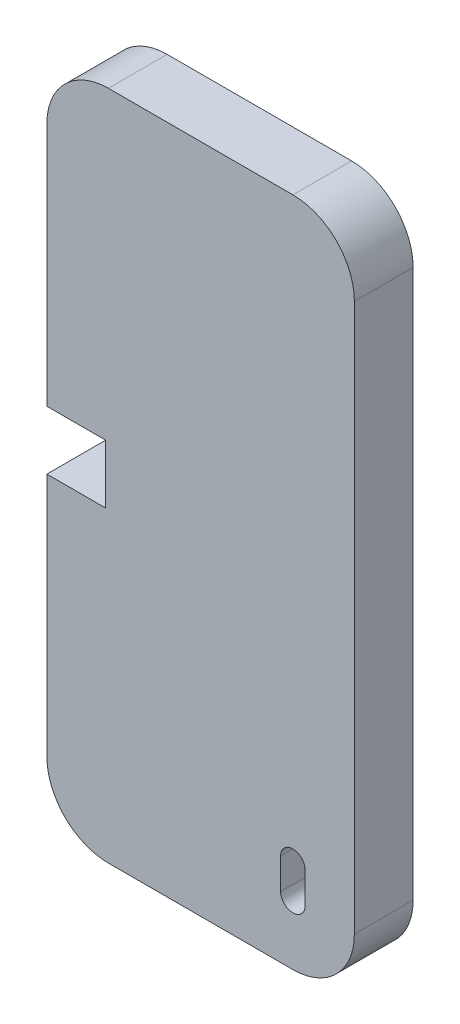
ISO-10303-21;
HEADER;
FILE_DESCRIPTION(('STEP AP214'),'2;1');
FILE_NAME('part.step','',(''),(''),'','','');
FILE_SCHEMA(('AUTOMOTIVE_DESIGN { 1 0 10303 214 1 1 1 1 }'));
ENDSEC;
DATA;
#1=APPLICATION_CONTEXT('core data for automotive mechanical design processes');
#2=APPLICATION_PROTOCOL_DEFINITION('international standard','automotive_design',2000,#1);
#3=PRODUCT_CONTEXT('',#1,'mechanical');
#4=PRODUCT('Part','Part','',(#3));
#5=PRODUCT_RELATED_PRODUCT_CATEGORY('part','',(#4));
#6=PRODUCT_DEFINITION_FORMATION('','',#4);
#7=PRODUCT_DEFINITION_CONTEXT('part definition',#1,'design');
#8=PRODUCT_DEFINITION('design','',#6,#7);
#9=PRODUCT_DEFINITION_SHAPE('','',#8);
#10=(LENGTH_UNIT() NAMED_UNIT(*) SI_UNIT(.MILLI.,.METRE.));
#11=(NAMED_UNIT(*) PLANE_ANGLE_UNIT() SI_UNIT($,.RADIAN.));
#12=(NAMED_UNIT(*) SI_UNIT($,.STERADIAN.) SOLID_ANGLE_UNIT());
#13=UNCERTAINTY_MEASURE_WITH_UNIT(LENGTH_MEASURE(1.E-05),#10,'distance_accuracy_value','');
#14=(GEOMETRIC_REPRESENTATION_CONTEXT(3) GLOBAL_UNCERTAINTY_ASSIGNED_CONTEXT((#13)) GLOBAL_UNIT_ASSIGNED_CONTEXT((#10,
#11,#12)) REPRESENTATION_CONTEXT('',''));
#15=CARTESIAN_POINT('',(0.,0.,0.));
#16=DIRECTION('',(0.,0.,1.));
#17=DIRECTION('',(1.,0.,0.));
#18=AXIS2_PLACEMENT_3D('',#15,#16,#17);
#19=CARTESIAN_POINT('',(-4.55039999999973,44.7752,4.7752));
#20=DIRECTION('',(1.,0.,0.));
#21=DIRECTION('',(0.,1.,0.));
#22=AXIS2_PLACEMENT_3D('',#19,#20,#21);
#23=PLANE('',#22);
#24=DIRECTION('',(0.,0.,1.));
#25=VECTOR('',#24,1.);
#26=CARTESIAN_POINT('',(-4.55039999999981,20.1124,0.));
#27=LINE('',#26,#25);
#28=CARTESIAN_POINT('',(-4.55039999999981,20.1124,0.));
#29=VERTEX_POINT('',#28);
#30=CARTESIAN_POINT('',(-4.55039999999981,20.1124,4.7752));
#31=VERTEX_POINT('',#30);
#32=EDGE_CURVE('E205',#29,#31,#27,.T.);
#33=ORIENTED_EDGE('',*,*,#32,.F.);
#34=DIRECTION('',(0.,-1.,0.));
#35=VECTOR('',#34,1.);
#36=CARTESIAN_POINT('',(-4.55039999999973,44.7752,0.));
#37=LINE('',#36,#35);
#38=CARTESIAN_POINT('',(-4.55039999999988,0.224799999999953,0.));
#39=VERTEX_POINT('',#38);
#40=EDGE_CURVE('E260',#29,#39,#37,.T.);
#41=ORIENTED_EDGE('',*,*,#40,.T.);
#42=DIRECTION('',(0.,0.,-1.));
#43=VECTOR('',#42,1.);
#44=CARTESIAN_POINT('',(-4.55039999999988,0.224799999999953,4.7752));
#45=LINE('',#44,#43);
#46=CARTESIAN_POINT('',(-4.55039999999988,0.224799999999953,4.7752));
#47=VERTEX_POINT('',#46);
#48=EDGE_CURVE('E305',#47,#39,#45,.T.);
#49=ORIENTED_EDGE('',*,*,#48,.F.);
#50=DIRECTION('',(0.,-1.,0.));
#51=VECTOR('',#50,1.);
#52=CARTESIAN_POINT('',(-4.55039999999973,44.7752,4.7752));
#53=LINE('',#52,#51);
#54=EDGE_CURVE('E232',#31,#47,#53,.T.);
#55=ORIENTED_EDGE('',*,*,#54,.F.);
#56=EDGE_LOOP('',(#33,#41,#49,#55));
#57=FACE_BOUND('',#56,.T.);
#58=ADVANCED_FACE('F44',(#57),#23,.F.);
#59=CARTESIAN_POINT('',(0.449600000000273,44.7751999999999,4.7752));
#60=DIRECTION('',(0.,0.,-1.));
#61=DIRECTION('',(-1.,0.,0.));
#62=AXIS2_PLACEMENT_3D('',#59,#60,#61);
#63=CYLINDRICAL_SURFACE('',#62,5.);
#64=CARTESIAN_POINT('',(0.449600000000273,44.7751999999999,0.));
#65=DIRECTION('',(0.,0.,1.));
#66=DIRECTION('',(-1.,0.,0.));
#67=AXIS2_PLACEMENT_3D('',#64,#65,#66);
#68=CIRCLE('',#67,5.);
#69=CARTESIAN_POINT('',(0.449600000000274,49.7751999999999,0.));
#70=VERTEX_POINT('',#69);
#71=CARTESIAN_POINT('',(-4.55039999999973,44.7752,0.));
#72=VERTEX_POINT('',#71);
#73=EDGE_CURVE('E219',#70,#72,#68,.T.);
#74=ORIENTED_EDGE('',*,*,#73,.T.);
#75=DIRECTION('',(0.,0.,-1.));
#76=VECTOR('',#75,1.);
#77=CARTESIAN_POINT('',(-4.55039999999973,44.7752,4.7752));
#78=LINE('',#77,#76);
#79=CARTESIAN_POINT('',(-4.55039999999973,44.7752,4.7752));
#80=VERTEX_POINT('',#79);
#81=EDGE_CURVE('E309',#80,#72,#78,.T.);
#82=ORIENTED_EDGE('',*,*,#81,.F.);
#83=CARTESIAN_POINT('',(0.449600000000273,44.7751999999999,4.7752));
#84=DIRECTION('',(0.,0.,1.));
#85=DIRECTION('',(-1.,0.,0.));
#86=AXIS2_PLACEMENT_3D('',#83,#84,#85);
#87=CIRCLE('',#86,5.);
#88=CARTESIAN_POINT('',(0.449600000000274,49.7751999999999,4.7752));
#89=VERTEX_POINT('',#88);
#90=EDGE_CURVE('E228',#89,#80,#87,.T.);
#91=ORIENTED_EDGE('',*,*,#90,.F.);
#92=DIRECTION('',(0.,0.,-1.));
#93=VECTOR('',#92,1.);
#94=CARTESIAN_POINT('',(0.449600000000274,49.7751999999999,4.7752));
#95=LINE('',#94,#93);
#96=EDGE_CURVE('E256',#89,#70,#95,.T.);
#97=ORIENTED_EDGE('',*,*,#96,.T.);
#98=EDGE_LOOP('',(#74,#82,#91,#97));
#99=FACE_BOUND('',#98,.T.);
#100=ADVANCED_FACE('F46',(#99),#63,.T.);
#101=CARTESIAN_POINT('',(-4.5503999999998,24.8876,0.));
#102=VERTEX_POINT('',#101);
#103=EDGE_CURVE('E261',#72,#102,#37,.T.);
#104=ORIENTED_EDGE('',*,*,#103,.T.);
#105=DIRECTION('',(0.,0.,1.));
#106=VECTOR('',#105,1.);
#107=CARTESIAN_POINT('',(-4.5503999999998,24.8876,0.));
#108=LINE('',#107,#106);
#109=CARTESIAN_POINT('',(-4.5503999999998,24.8876,4.7752));
#110=VERTEX_POINT('',#109);
#111=EDGE_CURVE('E215',#102,#110,#108,.T.);
#112=ORIENTED_EDGE('',*,*,#111,.T.);
#113=EDGE_CURVE('E234',#80,#110,#53,.T.);
#114=ORIENTED_EDGE('',*,*,#113,.F.);
#115=ORIENTED_EDGE('',*,*,#81,.T.);
#116=EDGE_LOOP('',(#104,#112,#114,#115));
#117=FACE_BOUND('',#116,.T.);
#118=ADVANCED_FACE('F343',(#117),#23,.F.);
#119=CARTESIAN_POINT('',(0.449600000000116,0.224799999999933,4.7752));
#120=DIRECTION('',(0.,0.,-1.));
#121=DIRECTION('',(-1.,0.,0.));
#122=AXIS2_PLACEMENT_3D('',#119,#120,#121);
#123=CYLINDRICAL_SURFACE('',#122,5.);
#124=CARTESIAN_POINT('',(0.449600000000116,0.224799999999933,0.));
#125=DIRECTION('',(0.,0.,1.));
#126=DIRECTION('',(1.,0.,0.));
#127=AXIS2_PLACEMENT_3D('',#124,#125,#126);
#128=CIRCLE('',#127,5.);
#129=CARTESIAN_POINT('',(0.449600000000115,-4.77520000000007,0.));
#130=VERTEX_POINT('',#129);
#131=EDGE_CURVE('E265',#39,#130,#128,.T.);
#132=ORIENTED_EDGE('',*,*,#131,.T.);
#133=DIRECTION('',(0.,0.,-1.));
#134=VECTOR('',#133,1.);
#135=CARTESIAN_POINT('',(0.449600000000115,-4.77520000000007,4.7752));
#136=LINE('',#135,#134);
#137=CARTESIAN_POINT('',(0.449600000000115,-4.77520000000007,4.7752));
#138=VERTEX_POINT('',#137);
#139=EDGE_CURVE('E301',#138,#130,#136,.T.);
#140=ORIENTED_EDGE('',*,*,#139,.F.);
#141=CARTESIAN_POINT('',(0.449600000000116,0.224799999999933,4.7752));
#142=DIRECTION('',(0.,0.,1.));
#143=DIRECTION('',(1.,0.,0.));
#144=AXIS2_PLACEMENT_3D('',#141,#142,#143);
#145=CIRCLE('',#144,5.);
#146=EDGE_CURVE('E238',#47,#138,#145,.T.);
#147=ORIENTED_EDGE('',*,*,#146,.F.);
#148=ORIENTED_EDGE('',*,*,#48,.T.);
#149=EDGE_LOOP('',(#132,#140,#147,#148));
#150=FACE_BOUND('',#149,.T.);
#151=ADVANCED_FACE('F352',(#150),#123,.T.);
#152=CARTESIAN_POINT('',(0.449600000000116,-4.77520000000007,4.7752));
#153=DIRECTION('',(0.,1.,0.));
#154=DIRECTION('',(0.,0.,1.));
#155=AXIS2_PLACEMENT_3D('',#152,#153,#154);
#156=PLANE('',#155);
#157=DIRECTION('',(1.,0.,0.));
#158=VECTOR('',#157,1.);
#159=CARTESIAN_POINT('',(0.449600000000116,-4.77520000000007,0.));
#160=LINE('',#159,#158);
#161=CARTESIAN_POINT('',(15.4496000000001,-4.77520000000007,0.));
#162=VERTEX_POINT('',#161);
#163=EDGE_CURVE('E268',#130,#162,#160,.T.);
#164=ORIENTED_EDGE('',*,*,#163,.T.);
#165=DIRECTION('',(0.,0.,-1.));
#166=VECTOR('',#165,1.);
#167=CARTESIAN_POINT('',(15.4496000000001,-4.77520000000007,4.7752));
#168=LINE('',#167,#166);
#169=CARTESIAN_POINT('',(15.4496000000001,-4.77520000000007,4.7752));
#170=VERTEX_POINT('',#169);
#171=EDGE_CURVE('E297',#170,#162,#168,.T.);
#172=ORIENTED_EDGE('',*,*,#171,.F.);
#173=DIRECTION('',(1.,0.,0.));
#174=VECTOR('',#173,1.);
#175=CARTESIAN_POINT('',(0.449600000000116,-4.77520000000007,4.7752));
#176=LINE('',#175,#174);
#177=EDGE_CURVE('E241',#138,#170,#176,.T.);
#178=ORIENTED_EDGE('',*,*,#177,.F.);
#179=ORIENTED_EDGE('',*,*,#139,.T.);
#180=EDGE_LOOP('',(#164,#172,#178,#179));
#181=FACE_BOUND('',#180,.T.);
#182=ADVANCED_FACE('F358',(#181),#156,.F.);
#183=CARTESIAN_POINT('',(15.4496000000001,0.224799999999935,4.7752));
#184=DIRECTION('',(0.,0.,-1.));
#185=DIRECTION('',(-1.,0.,0.));
#186=AXIS2_PLACEMENT_3D('',#183,#184,#185);
#187=CYLINDRICAL_SURFACE('',#186,5.);
#188=CARTESIAN_POINT('',(15.4496000000001,0.224799999999935,0.));
#189=DIRECTION('',(0.,0.,1.));
#190=DIRECTION('',(1.,0.,0.));
#191=AXIS2_PLACEMENT_3D('',#188,#189,#190);
#192=CIRCLE('',#191,5.);
#193=CARTESIAN_POINT('',(20.4496000000001,0.224799999999935,0.));
#194=VERTEX_POINT('',#193);
#195=EDGE_CURVE('E271',#162,#194,#192,.T.);
#196=ORIENTED_EDGE('',*,*,#195,.T.);
#197=DIRECTION('',(0.,0.,-1.));
#198=VECTOR('',#197,1.);
#199=CARTESIAN_POINT('',(20.4496000000001,0.224799999999935,4.7752));
#200=LINE('',#199,#198);
#201=CARTESIAN_POINT('',(20.4496000000001,0.224799999999935,4.7752));
#202=VERTEX_POINT('',#201);
#203=EDGE_CURVE('E293',#202,#194,#200,.T.);
#204=ORIENTED_EDGE('',*,*,#203,.F.);
#205=CARTESIAN_POINT('',(15.4496000000001,0.224799999999935,4.7752));
#206=DIRECTION('',(0.,0.,1.));
#207=DIRECTION('',(1.,0.,0.));
#208=AXIS2_PLACEMENT_3D('',#205,#206,#207);
#209=CIRCLE('',#208,5.);
#210=EDGE_CURVE('E244',#170,#202,#209,.T.);
#211=ORIENTED_EDGE('',*,*,#210,.F.);
#212=ORIENTED_EDGE('',*,*,#171,.T.);
#213=EDGE_LOOP('',(#196,#204,#211,#212));
#214=FACE_BOUND('',#213,.T.);
#215=ADVANCED_FACE('F388',(#214),#187,.T.);
#216=CARTESIAN_POINT('',(20.4496000000003,44.7751999999999,4.7752));
#217=DIRECTION('',(-1.,0.,0.));
#218=DIRECTION('',(0.,-1.,0.));
#219=AXIS2_PLACEMENT_3D('',#216,#217,#218);
#220=PLANE('',#219);
#221=DIRECTION('',(0.,1.,0.));
#222=VECTOR('',#221,1.);
#223=CARTESIAN_POINT('',(20.4496000000003,44.7751999999999,0.));
#224=LINE('',#223,#222);
#225=CARTESIAN_POINT('',(20.4496000000003,44.7751999999999,0.));
#226=VERTEX_POINT('',#225);
#227=EDGE_CURVE('E274',#194,#226,#224,.T.);
#228=ORIENTED_EDGE('',*,*,#227,.T.);
#229=DIRECTION('',(0.,0.,-1.));
#230=VECTOR('',#229,1.);
#231=CARTESIAN_POINT('',(20.4496000000003,44.7751999999999,4.7752));
#232=LINE('',#231,#230);
#233=CARTESIAN_POINT('',(20.4496000000003,44.7751999999999,4.7752));
#234=VERTEX_POINT('',#233);
#235=EDGE_CURVE('E289',#234,#226,#232,.T.);
#236=ORIENTED_EDGE('',*,*,#235,.F.);
#237=DIRECTION('',(0.,1.,0.));
#238=VECTOR('',#237,1.);
#239=CARTESIAN_POINT('',(20.4496000000003,44.7751999999999,4.7752));
#240=LINE('',#239,#238);
#241=EDGE_CURVE('E247',#202,#234,#240,.T.);
#242=ORIENTED_EDGE('',*,*,#241,.F.);
#243=ORIENTED_EDGE('',*,*,#203,.T.);
#244=EDGE_LOOP('',(#228,#236,#242,#243));
#245=FACE_BOUND('',#244,.T.);
#246=ADVANCED_FACE('F384',(#245),#220,.F.);
#247=CARTESIAN_POINT('',(15.4496000000003,44.7751999999999,4.7752));
#248=DIRECTION('',(0.,0.,-1.));
#249=DIRECTION('',(-1.,0.,0.));
#250=AXIS2_PLACEMENT_3D('',#247,#248,#249);
#251=CYLINDRICAL_SURFACE('',#250,5.);
#252=CARTESIAN_POINT('',(15.4496000000003,44.7751999999999,0.));
#253=DIRECTION('',(0.,0.,1.));
#254=DIRECTION('',(-1.,0.,0.));
#255=AXIS2_PLACEMENT_3D('',#252,#253,#254);
#256=CIRCLE('',#255,5.);
#257=CARTESIAN_POINT('',(15.4496000000003,49.7751999999999,0.));
#258=VERTEX_POINT('',#257);
#259=EDGE_CURVE('E277',#226,#258,#256,.T.);
#260=ORIENTED_EDGE('',*,*,#259,.T.);
#261=DIRECTION('',(0.,0.,-1.));
#262=VECTOR('',#261,1.);
#263=CARTESIAN_POINT('',(15.4496000000003,49.7751999999999,4.7752));
#264=LINE('',#263,#262);
#265=CARTESIAN_POINT('',(15.4496000000003,49.7751999999999,4.7752));
#266=VERTEX_POINT('',#265);
#267=EDGE_CURVE('E285',#266,#258,#264,.T.);
#268=ORIENTED_EDGE('',*,*,#267,.F.);
#269=CARTESIAN_POINT('',(15.4496000000003,44.7751999999999,4.7752));
#270=DIRECTION('',(0.,0.,1.));
#271=DIRECTION('',(-1.,0.,0.));
#272=AXIS2_PLACEMENT_3D('',#269,#270,#271);
#273=CIRCLE('',#272,5.);
#274=EDGE_CURVE('E250',#234,#266,#273,.T.);
#275=ORIENTED_EDGE('',*,*,#274,.F.);
#276=ORIENTED_EDGE('',*,*,#235,.T.);
#277=EDGE_LOOP('',(#260,#268,#275,#276));
#278=FACE_BOUND('',#277,.T.);
#279=ADVANCED_FACE('F379',(#278),#251,.T.);
#280=CARTESIAN_POINT('',(0.449600000000274,49.7751999999999,4.7752));
#281=DIRECTION('',(0.,-1.,0.));
#282=DIRECTION('',(0.,0.,-1.));
#283=AXIS2_PLACEMENT_3D('',#280,#281,#282);
#284=PLANE('',#283);
#285=DIRECTION('',(-1.,0.,0.));
#286=VECTOR('',#285,1.);
#287=CARTESIAN_POINT('',(0.449600000000274,49.7751999999999,0.));
#288=LINE('',#287,#286);
#289=EDGE_CURVE('E233',#258,#70,#288,.T.);
#290=ORIENTED_EDGE('',*,*,#289,.T.);
#291=ORIENTED_EDGE('',*,*,#96,.F.);
#292=DIRECTION('',(-1.,0.,0.));
#293=VECTOR('',#292,1.);
#294=CARTESIAN_POINT('',(0.449600000000274,49.7751999999999,4.7752));
#295=LINE('',#294,#293);
#296=EDGE_CURVE('E253',#266,#89,#295,.T.);
#297=ORIENTED_EDGE('',*,*,#296,.F.);
#298=ORIENTED_EDGE('',*,*,#267,.T.);
#299=EDGE_LOOP('',(#290,#291,#297,#298));
#300=FACE_BOUND('',#299,.T.);
#301=ADVANCED_FACE('F373',(#300),#284,.F.);
#302=CARTESIAN_POINT('',(0.449600000000273,44.7751999999999,4.7752));
#303=DIRECTION('',(0.,0.,-1.));
#304=DIRECTION('',(-1.,0.,0.));
#305=AXIS2_PLACEMENT_3D('',#302,#303,#304);
#306=PLANE('',#305);
#307=DIRECTION('',(0.,-1.,0.));
#308=VECTOR('',#307,1.);
#309=CARTESIAN_POINT('',(14.4496000000001,0.,4.7752));
#310=LINE('',#309,#308);
#311=CARTESIAN_POINT('',(14.4496000000001,2.72479999999993,4.7752));
#312=VERTEX_POINT('',#311);
#313=CARTESIAN_POINT('',(14.4496000000001,0.224799999999935,4.7752));
#314=VERTEX_POINT('',#313);
#315=EDGE_CURVE('E170',#312,#314,#310,.T.);
#316=ORIENTED_EDGE('',*,*,#315,.F.);
#317=CARTESIAN_POINT('',(15.4496000000001,2.72479999999993,4.7752));
#318=DIRECTION('',(0.,0.,1.));
#319=DIRECTION('',(1.,0.,0.));
#320=AXIS2_PLACEMENT_3D('',#317,#318,#319);
#321=CIRCLE('',#320,1.);
#322=CARTESIAN_POINT('',(16.4496000000001,2.72479999999993,4.7752));
#323=VERTEX_POINT('',#322);
#324=EDGE_CURVE('E60',#323,#312,#321,.T.);
#325=ORIENTED_EDGE('',*,*,#324,.F.);
#326=DIRECTION('',(0.,-1.,0.));
#327=VECTOR('',#326,1.);
#328=CARTESIAN_POINT('',(16.4496000000001,0.,4.7752));
#329=LINE('',#328,#327);
#330=CARTESIAN_POINT('',(16.4496000000001,0.224799999999935,4.7752));
#331=VERTEX_POINT('',#330);
#332=EDGE_CURVE('E178',#323,#331,#329,.T.);
#333=ORIENTED_EDGE('',*,*,#332,.T.);
#334=CARTESIAN_POINT('',(15.4496000000001,0.224799999999935,4.7752));
#335=DIRECTION('',(0.,0.,1.));
#336=DIRECTION('',(1.,0.,0.));
#337=AXIS2_PLACEMENT_3D('',#334,#335,#336);
#338=CIRCLE('',#337,1.);
#339=EDGE_CURVE('E160',#314,#331,#338,.T.);
#340=ORIENTED_EDGE('',*,*,#339,.F.);
#341=EDGE_LOOP('',(#316,#325,#333,#340));
#342=FACE_BOUND('',#341,.T.);
#343=ORIENTED_EDGE('',*,*,#113,.T.);
#344=DIRECTION('',(-1.,0.,0.));
#345=VECTOR('',#344,1.);
#346=CARTESIAN_POINT('',(0.,24.8876,4.7752));
#347=LINE('',#346,#345);
#348=CARTESIAN_POINT('',(0.224800000000277,24.8876,4.7752));
#349=VERTEX_POINT('',#348);
#350=EDGE_CURVE('E197',#349,#110,#347,.T.);
#351=ORIENTED_EDGE('',*,*,#350,.F.);
#352=DIRECTION('',(0.,1.,0.));
#353=VECTOR('',#352,1.);
#354=CARTESIAN_POINT('',(0.224800000000277,0.,4.7752));
#355=LINE('',#354,#353);
#356=CARTESIAN_POINT('',(0.224800000000277,20.1124,4.7752));
#357=VERTEX_POINT('',#356);
#358=EDGE_CURVE('E209',#357,#349,#355,.T.);
#359=ORIENTED_EDGE('',*,*,#358,.F.);
#360=DIRECTION('',(-1.,0.,0.));
#361=VECTOR('',#360,1.);
#362=CARTESIAN_POINT('',(0.,20.1124,4.7752));
#363=LINE('',#362,#361);
#364=EDGE_CURVE('E188',#357,#31,#363,.T.);
#365=ORIENTED_EDGE('',*,*,#364,.T.);
#366=ORIENTED_EDGE('',*,*,#54,.T.);
#367=ORIENTED_EDGE('',*,*,#146,.T.);
#368=ORIENTED_EDGE('',*,*,#177,.T.);
#369=ORIENTED_EDGE('',*,*,#210,.T.);
#370=ORIENTED_EDGE('',*,*,#241,.T.);
#371=ORIENTED_EDGE('',*,*,#274,.T.);
#372=ORIENTED_EDGE('',*,*,#296,.T.);
#373=ORIENTED_EDGE('',*,*,#90,.T.);
#374=EDGE_LOOP('',(#343,#351,#359,#365,#366,#367,#368,#369,#370,#371,#372,#373));
#375=FACE_BOUND('',#374,.T.);
#376=ADVANCED_FACE('F175',(#342,#375),#306,.F.);
#377=CARTESIAN_POINT('',(0.449600000000273,44.7751999999999,0.));
#378=DIRECTION('',(0.,0.,-1.));
#379=DIRECTION('',(-1.,0.,0.));
#380=AXIS2_PLACEMENT_3D('',#377,#378,#379);
#381=PLANE('',#380);
#382=CARTESIAN_POINT('',(15.4496000000001,2.72479999999993,0.));
#383=DIRECTION('',(0.,0.,-1.));
#384=DIRECTION('',(-1.,0.,0.));
#385=AXIS2_PLACEMENT_3D('',#382,#383,#384);
#386=CIRCLE('',#385,1.);
#387=CARTESIAN_POINT('',(14.4496000000001,2.72479999999993,0.));
#388=VERTEX_POINT('',#387);
#389=CARTESIAN_POINT('',(16.4496000000001,2.72479999999993,0.));
#390=VERTEX_POINT('',#389);
#391=EDGE_CURVE('E11',#388,#390,#386,.T.);
#392=ORIENTED_EDGE('',*,*,#391,.F.);
#393=DIRECTION('',(0.,1.,0.));
#394=VECTOR('',#393,1.);
#395=CARTESIAN_POINT('',(14.4496000000001,44.7751999999999,0.));
#396=LINE('',#395,#394);
#397=CARTESIAN_POINT('',(14.4496000000001,0.224799999999935,0.));
#398=VERTEX_POINT('',#397);
#399=EDGE_CURVE('E313',#398,#388,#396,.T.);
#400=ORIENTED_EDGE('',*,*,#399,.F.);
#401=CARTESIAN_POINT('',(15.4496000000001,0.224799999999935,0.));
#402=DIRECTION('',(0.,0.,-1.));
#403=DIRECTION('',(-1.,0.,0.));
#404=AXIS2_PLACEMENT_3D('',#401,#402,#403);
#405=CIRCLE('',#404,1.);
#406=CARTESIAN_POINT('',(16.4496000000001,0.224799999999935,0.));
#407=VERTEX_POINT('',#406);
#408=EDGE_CURVE('E163',#407,#398,#405,.T.);
#409=ORIENTED_EDGE('',*,*,#408,.F.);
#410=DIRECTION('',(0.,1.,0.));
#411=VECTOR('',#410,1.);
#412=CARTESIAN_POINT('',(16.4496,44.7752,0.));
#413=LINE('',#412,#411);
#414=EDGE_CURVE('E53',#407,#390,#413,.T.);
#415=ORIENTED_EDGE('',*,*,#414,.T.);
#416=EDGE_LOOP('',(#392,#400,#409,#415));
#417=FACE_BOUND('',#416,.T.);
#418=DIRECTION('',(-1.,0.,0.));
#419=VECTOR('',#418,1.);
#420=CARTESIAN_POINT('',(0.,24.8876,0.));
#421=LINE('',#420,#419);
#422=CARTESIAN_POINT('',(0.224800000000277,24.8876,0.));
#423=VERTEX_POINT('',#422);
#424=EDGE_CURVE('E201',#423,#102,#421,.T.);
#425=ORIENTED_EDGE('',*,*,#424,.T.);
#426=ORIENTED_EDGE('',*,*,#103,.F.);
#427=ORIENTED_EDGE('',*,*,#73,.F.);
#428=ORIENTED_EDGE('',*,*,#289,.F.);
#429=ORIENTED_EDGE('',*,*,#259,.F.);
#430=ORIENTED_EDGE('',*,*,#227,.F.);
#431=ORIENTED_EDGE('',*,*,#195,.F.);
#432=ORIENTED_EDGE('',*,*,#163,.F.);
#433=ORIENTED_EDGE('',*,*,#131,.F.);
#434=ORIENTED_EDGE('',*,*,#40,.F.);
#435=DIRECTION('',(-1.,0.,0.));
#436=VECTOR('',#435,1.);
#437=CARTESIAN_POINT('',(0.,20.1124,0.));
#438=LINE('',#437,#436);
#439=CARTESIAN_POINT('',(0.224800000000277,20.1124,0.));
#440=VERTEX_POINT('',#439);
#441=EDGE_CURVE('E193',#440,#29,#438,.T.);
#442=ORIENTED_EDGE('',*,*,#441,.F.);
#443=DIRECTION('',(0.,1.,0.));
#444=VECTOR('',#443,1.);
#445=CARTESIAN_POINT('',(0.224800000000277,0.,0.));
#446=LINE('',#445,#444);
#447=EDGE_CURVE('E196',#440,#423,#446,.T.);
#448=ORIENTED_EDGE('',*,*,#447,.T.);
#449=EDGE_LOOP('',(#425,#426,#427,#428,#429,#430,#431,#432,#433,#434,#442,#448));
#450=FACE_BOUND('',#449,.T.);
#451=ADVANCED_FACE('F321',(#417,#450),#381,.T.);
#452=CARTESIAN_POINT('',(0.,24.8876,0.));
#453=DIRECTION('',(0.,1.,0.));
#454=DIRECTION('',(0.,0.,1.));
#455=AXIS2_PLACEMENT_3D('',#452,#453,#454);
#456=PLANE('',#455);
#457=ORIENTED_EDGE('',*,*,#350,.T.);
#458=ORIENTED_EDGE('',*,*,#111,.F.);
#459=ORIENTED_EDGE('',*,*,#424,.F.);
#460=DIRECTION('',(0.,0.,1.));
#461=VECTOR('',#460,1.);
#462=CARTESIAN_POINT('',(0.224800000000277,24.8876,0.));
#463=LINE('',#462,#461);
#464=EDGE_CURVE('E220',#423,#349,#463,.T.);
#465=ORIENTED_EDGE('',*,*,#464,.T.);
#466=EDGE_LOOP('',(#457,#458,#459,#465));
#467=FACE_BOUND('',#466,.T.);
#468=ADVANCED_FACE('F366',(#467),#456,.F.);
#469=CARTESIAN_POINT('',(0.224800000000277,0.,0.));
#470=DIRECTION('',(1.,0.,0.));
#471=DIRECTION('',(0.,0.,-1.));
#472=AXIS2_PLACEMENT_3D('',#469,#470,#471);
#473=PLANE('',#472);
#474=ORIENTED_EDGE('',*,*,#358,.T.);
#475=ORIENTED_EDGE('',*,*,#464,.F.);
#476=ORIENTED_EDGE('',*,*,#447,.F.);
#477=DIRECTION('',(0.,0.,1.));
#478=VECTOR('',#477,1.);
#479=CARTESIAN_POINT('',(0.224800000000277,20.1124,0.));
#480=LINE('',#479,#478);
#481=EDGE_CURVE('E223',#440,#357,#480,.T.);
#482=ORIENTED_EDGE('',*,*,#481,.T.);
#483=EDGE_LOOP('',(#474,#475,#476,#482));
#484=FACE_BOUND('',#483,.T.);
#485=ADVANCED_FACE('F336',(#484),#473,.F.);
#486=CARTESIAN_POINT('',(0.,20.1124,0.));
#487=DIRECTION('',(0.,1.,0.));
#488=DIRECTION('',(0.,0.,1.));
#489=AXIS2_PLACEMENT_3D('',#486,#487,#488);
#490=PLANE('',#489);
#491=ORIENTED_EDGE('',*,*,#364,.F.);
#492=ORIENTED_EDGE('',*,*,#481,.F.);
#493=ORIENTED_EDGE('',*,*,#441,.T.);
#494=ORIENTED_EDGE('',*,*,#32,.T.);
#495=EDGE_LOOP('',(#491,#492,#493,#494));
#496=FACE_BOUND('',#495,.T.);
#497=ADVANCED_FACE('F328',(#496),#490,.T.);
#498=CARTESIAN_POINT('',(15.4496000000001,2.72479999999993,-5.2248));
#499=DIRECTION('',(0.,0.,1.));
#500=DIRECTION('',(1.,0.,0.));
#501=AXIS2_PLACEMENT_3D('',#498,#499,#500);
#502=CYLINDRICAL_SURFACE('',#501,1.);
#503=ORIENTED_EDGE('',*,*,#391,.T.);
#504=DIRECTION('',(0.,0.,1.));
#505=VECTOR('',#504,1.);
#506=CARTESIAN_POINT('',(16.4496000000001,2.72479999999993,-5.2248));
#507=LINE('',#506,#505);
#508=EDGE_CURVE('E185',#390,#323,#507,.T.);
#509=ORIENTED_EDGE('',*,*,#508,.T.);
#510=ORIENTED_EDGE('',*,*,#324,.T.);
#511=DIRECTION('',(0.,0.,1.));
#512=VECTOR('',#511,1.);
#513=CARTESIAN_POINT('',(14.4496000000001,2.72479999999993,-5.2248));
#514=LINE('',#513,#512);
#515=EDGE_CURVE('E167',#388,#312,#514,.T.);
#516=ORIENTED_EDGE('',*,*,#515,.F.);
#517=EDGE_LOOP('',(#503,#509,#510,#516));
#518=FACE_BOUND('',#517,.T.);
#519=ADVANCED_FACE('F326',(#518),#502,.F.);
#520=CARTESIAN_POINT('',(16.4496000000001,0.,-5.2248));
#521=DIRECTION('',(-1.,0.,0.));
#522=DIRECTION('',(0.,-1.,0.));
#523=AXIS2_PLACEMENT_3D('',#520,#521,#522);
#524=PLANE('',#523);
#525=DIRECTION('',(0.,0.,1.));
#526=VECTOR('',#525,1.);
#527=CARTESIAN_POINT('',(16.4496000000001,0.224799999999935,-5.2248));
#528=LINE('',#527,#526);
#529=EDGE_CURVE('E166',#407,#331,#528,.T.);
#530=ORIENTED_EDGE('',*,*,#529,.T.);
#531=ORIENTED_EDGE('',*,*,#332,.F.);
#532=ORIENTED_EDGE('',*,*,#508,.F.);
#533=ORIENTED_EDGE('',*,*,#414,.F.);
#534=EDGE_LOOP('',(#530,#531,#532,#533));
#535=FACE_BOUND('',#534,.T.);
#536=ADVANCED_FACE('F325',(#535),#524,.T.);
#537=CARTESIAN_POINT('',(15.4496000000001,0.224799999999935,-5.2248));
#538=DIRECTION('',(0.,0.,1.));
#539=DIRECTION('',(1.,0.,0.));
#540=AXIS2_PLACEMENT_3D('',#537,#538,#539);
#541=CYLINDRICAL_SURFACE('',#540,1.);
#542=ORIENTED_EDGE('',*,*,#408,.T.);
#543=DIRECTION('',(0.,0.,1.));
#544=VECTOR('',#543,1.);
#545=CARTESIAN_POINT('',(14.4496000000001,0.224799999999935,-5.2248));
#546=LINE('',#545,#544);
#547=EDGE_CURVE('E68',#398,#314,#546,.T.);
#548=ORIENTED_EDGE('',*,*,#547,.T.);
#549=ORIENTED_EDGE('',*,*,#339,.T.);
#550=ORIENTED_EDGE('',*,*,#529,.F.);
#551=EDGE_LOOP('',(#542,#548,#549,#550));
#552=FACE_BOUND('',#551,.T.);
#553=ADVANCED_FACE('F157',(#552),#541,.F.);
#554=CARTESIAN_POINT('',(14.4496000000001,0.,-5.2248));
#555=DIRECTION('',(-1.,0.,0.));
#556=DIRECTION('',(0.,0.,1.));
#557=AXIS2_PLACEMENT_3D('',#554,#555,#556);
#558=PLANE('',#557);
#559=ORIENTED_EDGE('',*,*,#399,.T.);
#560=ORIENTED_EDGE('',*,*,#515,.T.);
#561=ORIENTED_EDGE('',*,*,#315,.T.);
#562=ORIENTED_EDGE('',*,*,#547,.F.);
#563=EDGE_LOOP('',(#559,#560,#561,#562));
#564=FACE_BOUND('',#563,.T.);
#565=ADVANCED_FACE('F171',(#564),#558,.F.);
#566=CLOSED_SHELL('',(#58,#100,#118,#151,#182,#215,#246,#279,#301,#376,#451,#468,#485,#497,#519,
#536,#553,#565));
#567=MANIFOLD_SOLID_BREP('B2',#566);
#568=ADVANCED_BREP_SHAPE_REPRESENTATION('',(#18,#567),#14);
#569=SHAPE_DEFINITION_REPRESENTATION(#9,#568);
ENDSEC;
END-ISO-10303-21;
